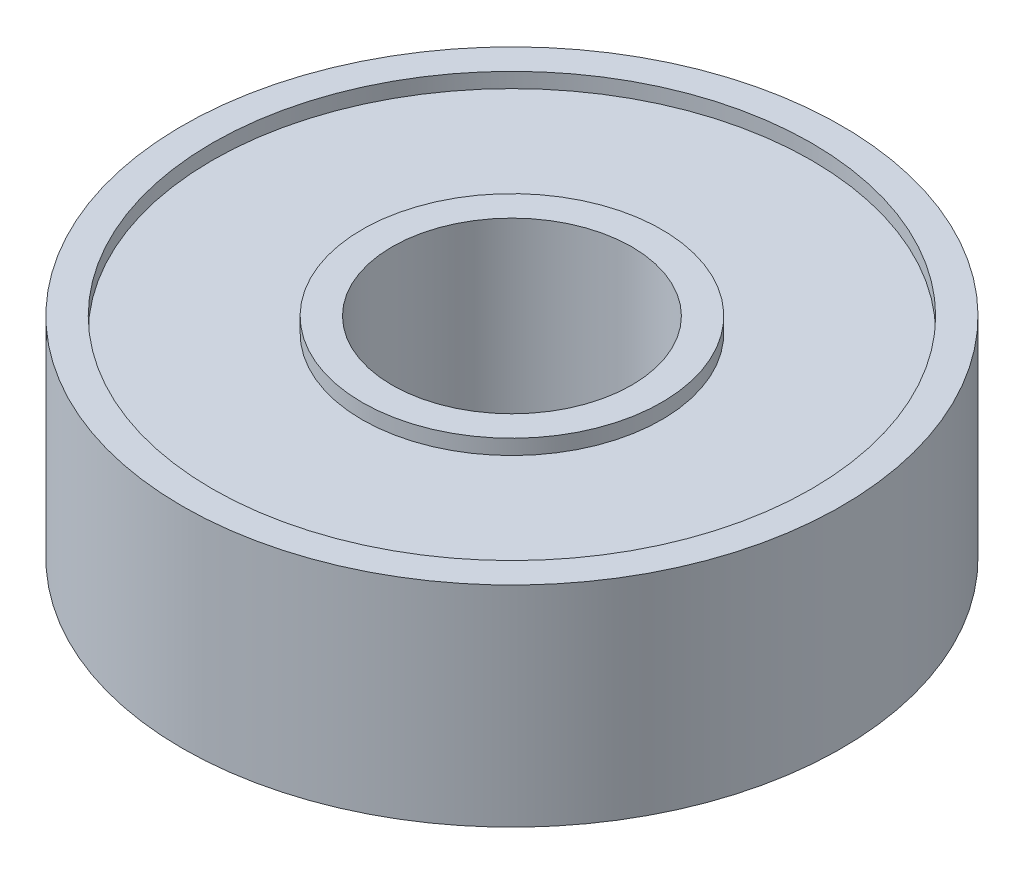
ISO-10303-21;
HEADER;
FILE_DESCRIPTION(('STEP AP214'),'2;1');
FILE_NAME('part.step','',(''),(''),'','','');
FILE_SCHEMA(('AUTOMOTIVE_DESIGN { 1 0 10303 214 1 1 1 1 }'));
ENDSEC;
DATA;
#1=APPLICATION_CONTEXT('core data for automotive mechanical design processes');
#2=APPLICATION_PROTOCOL_DEFINITION('international standard','automotive_design',2000,#1);
#3=PRODUCT_CONTEXT('',#1,'mechanical');
#4=PRODUCT('Part','Part','',(#3));
#5=PRODUCT_RELATED_PRODUCT_CATEGORY('part','',(#4));
#6=PRODUCT_DEFINITION_FORMATION('','',#4);
#7=PRODUCT_DEFINITION_CONTEXT('part definition',#1,'design');
#8=PRODUCT_DEFINITION('design','',#6,#7);
#9=PRODUCT_DEFINITION_SHAPE('','',#8);
#10=(LENGTH_UNIT() NAMED_UNIT(*) SI_UNIT(.MILLI.,.METRE.));
#11=(NAMED_UNIT(*) PLANE_ANGLE_UNIT() SI_UNIT($,.RADIAN.));
#12=(NAMED_UNIT(*) SI_UNIT($,.STERADIAN.) SOLID_ANGLE_UNIT());
#13=UNCERTAINTY_MEASURE_WITH_UNIT(LENGTH_MEASURE(1.E-05),#10,'distance_accuracy_value','');
#14=(GEOMETRIC_REPRESENTATION_CONTEXT(3) GLOBAL_UNCERTAINTY_ASSIGNED_CONTEXT((#13)) GLOBAL_UNIT_ASSIGNED_CONTEXT((#10,
#11,#12)) REPRESENTATION_CONTEXT('',''));
#15=CARTESIAN_POINT('',(0.,0.,0.));
#16=DIRECTION('',(0.,0.,1.));
#17=DIRECTION('',(1.,0.,0.));
#18=AXIS2_PLACEMENT_3D('',#15,#16,#17);
#19=CARTESIAN_POINT('',(0.,0.,0.));
#20=DIRECTION('',(0.,1.,0.));
#21=DIRECTION('',(0.,0.,1.));
#22=AXIS2_PLACEMENT_3D('',#19,#20,#21);
#23=PLANE('',#22);
#24=CARTESIAN_POINT('',(0.,0.,0.));
#25=DIRECTION('',(0.,1.,0.));
#26=DIRECTION('',(0.,0.,1.));
#27=AXIS2_PLACEMENT_3D('',#24,#25,#26);
#28=CIRCLE('',#27,4.);
#29=CARTESIAN_POINT('',(0.,0.,4.));
#30=VERTEX_POINT('',#29);
#31=EDGE_CURVE('E46',#30,#30,#28,.T.);
#32=ORIENTED_EDGE('',*,*,#31,.T.);
#33=EDGE_LOOP('',(#32));
#34=FACE_BOUND('',#33,.T.);
#35=CARTESIAN_POINT('',(0.,0.,0.));
#36=DIRECTION('',(0.,-1.,0.));
#37=DIRECTION('',(0.,0.,-1.));
#38=AXIS2_PLACEMENT_3D('',#35,#36,#37);
#39=CIRCLE('',#38,5.);
#40=CARTESIAN_POINT('',(0.,0.,-5.));
#41=VERTEX_POINT('',#40);
#42=EDGE_CURVE('E70',#41,#41,#39,.T.);
#43=ORIENTED_EDGE('',*,*,#42,.T.);
#44=EDGE_LOOP('',(#43));
#45=FACE_BOUND('',#44,.T.);
#46=ADVANCED_FACE('F35',(#34,#45),#23,.F.);
#47=CARTESIAN_POINT('',(0.,7.,0.));
#48=DIRECTION('',(0.,1.,0.));
#49=DIRECTION('',(0.,0.,1.));
#50=AXIS2_PLACEMENT_3D('',#47,#48,#49);
#51=PLANE('',#50);
#52=CARTESIAN_POINT('',(0.,7.,0.));
#53=DIRECTION('',(0.,1.,0.));
#54=DIRECTION('',(0.,0.,1.));
#55=AXIS2_PLACEMENT_3D('',#52,#53,#54);
#56=CIRCLE('',#55,4.);
#57=CARTESIAN_POINT('',(0.,7.,4.));
#58=VERTEX_POINT('',#57);
#59=EDGE_CURVE('E48',#58,#58,#56,.T.);
#60=ORIENTED_EDGE('',*,*,#59,.F.);
#61=EDGE_LOOP('',(#60));
#62=FACE_BOUND('',#61,.T.);
#63=CARTESIAN_POINT('',(0.,7.,0.));
#64=DIRECTION('',(0.,1.,0.));
#65=DIRECTION('',(0.,0.,1.));
#66=AXIS2_PLACEMENT_3D('',#63,#64,#65);
#67=CIRCLE('',#66,5.);
#68=CARTESIAN_POINT('',(0.,7.,5.));
#69=VERTEX_POINT('',#68);
#70=EDGE_CURVE('E58',#69,#69,#67,.T.);
#71=ORIENTED_EDGE('',*,*,#70,.T.);
#72=EDGE_LOOP('',(#71));
#73=FACE_BOUND('',#72,.T.);
#74=ADVANCED_FACE('F101',(#62,#73),#51,.T.);
#75=CARTESIAN_POINT('',(0.,7.,0.));
#76=DIRECTION('',(0.,-1.,0.));
#77=DIRECTION('',(0.,0.,-1.));
#78=AXIS2_PLACEMENT_3D('',#75,#76,#77);
#79=CYLINDRICAL_SURFACE('',#78,11.);
#80=CARTESIAN_POINT('',(0.,7.,0.));
#81=DIRECTION('',(0.,1.,0.));
#82=DIRECTION('',(0.,0.,1.));
#83=AXIS2_PLACEMENT_3D('',#80,#81,#82);
#84=CIRCLE('',#83,11.);
#85=CARTESIAN_POINT('',(0.,7.,11.));
#86=VERTEX_POINT('',#85);
#87=EDGE_CURVE('E10',#86,#86,#84,.T.);
#88=ORIENTED_EDGE('',*,*,#87,.F.);
#89=EDGE_LOOP('',(#88));
#90=FACE_BOUND('',#89,.T.);
#91=CARTESIAN_POINT('',(0.,0.,0.));
#92=DIRECTION('',(0.,1.,0.));
#93=DIRECTION('',(0.,0.,1.));
#94=AXIS2_PLACEMENT_3D('',#91,#92,#93);
#95=CIRCLE('',#94,11.);
#96=CARTESIAN_POINT('',(0.,0.,11.));
#97=VERTEX_POINT('',#96);
#98=EDGE_CURVE('E39',#97,#97,#95,.T.);
#99=ORIENTED_EDGE('',*,*,#98,.T.);
#100=EDGE_LOOP('',(#99));
#101=FACE_BOUND('',#100,.T.);
#102=ADVANCED_FACE('F37',(#90,#101),#79,.T.);
#103=CARTESIAN_POINT('',(0.,7.,0.));
#104=DIRECTION('',(0.,1.,0.));
#105=DIRECTION('',(0.,0.,1.));
#106=AXIS2_PLACEMENT_3D('',#103,#104,#105);
#107=CIRCLE('',#106,10.);
#108=CARTESIAN_POINT('',(0.,7.,10.));
#109=VERTEX_POINT('',#108);
#110=EDGE_CURVE('E54',#109,#109,#107,.T.);
#111=ORIENTED_EDGE('',*,*,#110,.F.);
#112=EDGE_LOOP('',(#111));
#113=FACE_BOUND('',#112,.T.);
#114=ORIENTED_EDGE('',*,*,#87,.T.);
#115=EDGE_LOOP('',(#114));
#116=FACE_BOUND('',#115,.T.);
#117=ADVANCED_FACE('F97',(#113,#116),#51,.T.);
#118=CARTESIAN_POINT('',(0.,0.,0.));
#119=DIRECTION('',(0.,-1.,0.));
#120=DIRECTION('',(0.,0.,-1.));
#121=AXIS2_PLACEMENT_3D('',#118,#119,#120);
#122=CIRCLE('',#121,10.);
#123=CARTESIAN_POINT('',(0.,0.,-10.));
#124=VERTEX_POINT('',#123);
#125=EDGE_CURVE('E66',#124,#124,#122,.T.);
#126=ORIENTED_EDGE('',*,*,#125,.F.);
#127=EDGE_LOOP('',(#126));
#128=FACE_BOUND('',#127,.T.);
#129=ORIENTED_EDGE('',*,*,#98,.F.);
#130=EDGE_LOOP('',(#129));
#131=FACE_BOUND('',#130,.T.);
#132=ADVANCED_FACE('F93',(#128,#131),#23,.F.);
#133=CARTESIAN_POINT('',(0.,0.,0.));
#134=DIRECTION('',(0.,1.,0.));
#135=DIRECTION('',(0.,0.,1.));
#136=AXIS2_PLACEMENT_3D('',#133,#134,#135);
#137=CYLINDRICAL_SURFACE('',#136,4.);
#138=ORIENTED_EDGE('',*,*,#31,.F.);
#139=EDGE_LOOP('',(#138));
#140=FACE_BOUND('',#139,.T.);
#141=ORIENTED_EDGE('',*,*,#59,.T.);
#142=EDGE_LOOP('',(#141));
#143=FACE_BOUND('',#142,.T.);
#144=ADVANCED_FACE('F96',(#140,#143),#137,.F.);
#145=CARTESIAN_POINT('',(0.,6.5,0.));
#146=DIRECTION('',(0.,1.,0.));
#147=DIRECTION('',(0.,0.,1.));
#148=AXIS2_PLACEMENT_3D('',#145,#146,#147);
#149=CYLINDRICAL_SURFACE('',#148,5.);
#150=CARTESIAN_POINT('',(0.,6.5,0.));
#151=DIRECTION('',(0.,1.,0.));
#152=DIRECTION('',(0.,0.,1.));
#153=AXIS2_PLACEMENT_3D('',#150,#151,#152);
#154=CIRCLE('',#153,5.);
#155=CARTESIAN_POINT('',(0.,6.5,5.));
#156=VERTEX_POINT('',#155);
#157=EDGE_CURVE('E57',#156,#156,#154,.T.);
#158=ORIENTED_EDGE('',*,*,#157,.T.);
#159=EDGE_LOOP('',(#158));
#160=FACE_BOUND('',#159,.T.);
#161=ORIENTED_EDGE('',*,*,#70,.F.);
#162=EDGE_LOOP('',(#161));
#163=FACE_BOUND('',#162,.T.);
#164=ADVANCED_FACE('F118',(#160,#163),#149,.T.);
#165=CARTESIAN_POINT('',(0.,6.5,0.));
#166=DIRECTION('',(0.,1.,0.));
#167=DIRECTION('',(0.,0.,1.));
#168=AXIS2_PLACEMENT_3D('',#165,#166,#167);
#169=CYLINDRICAL_SURFACE('',#168,10.);
#170=CARTESIAN_POINT('',(0.,6.5,0.));
#171=DIRECTION('',(0.,1.,0.));
#172=DIRECTION('',(0.,0.,1.));
#173=AXIS2_PLACEMENT_3D('',#170,#171,#172);
#174=CIRCLE('',#173,10.);
#175=CARTESIAN_POINT('',(0.,6.5,10.));
#176=VERTEX_POINT('',#175);
#177=EDGE_CURVE('E51',#176,#176,#174,.T.);
#178=ORIENTED_EDGE('',*,*,#177,.F.);
#179=EDGE_LOOP('',(#178));
#180=FACE_BOUND('',#179,.T.);
#181=ORIENTED_EDGE('',*,*,#110,.T.);
#182=EDGE_LOOP('',(#181));
#183=FACE_BOUND('',#182,.T.);
#184=ADVANCED_FACE('F122',(#180,#183),#169,.F.);
#185=CARTESIAN_POINT('',(0.,6.5,0.));
#186=DIRECTION('',(0.,1.,0.));
#187=DIRECTION('',(0.,0.,1.));
#188=AXIS2_PLACEMENT_3D('',#185,#186,#187);
#189=PLANE('',#188);
#190=ORIENTED_EDGE('',*,*,#157,.F.);
#191=EDGE_LOOP('',(#190));
#192=FACE_BOUND('',#191,.T.);
#193=ORIENTED_EDGE('',*,*,#177,.T.);
#194=EDGE_LOOP('',(#193));
#195=FACE_BOUND('',#194,.T.);
#196=ADVANCED_FACE('F126',(#192,#195),#189,.T.);
#197=CARTESIAN_POINT('',(0.,0.5,0.));
#198=DIRECTION('',(0.,-1.,0.));
#199=DIRECTION('',(0.,0.,-1.));
#200=AXIS2_PLACEMENT_3D('',#197,#198,#199);
#201=CYLINDRICAL_SURFACE('',#200,5.);
#202=CARTESIAN_POINT('',(0.,0.5,0.));
#203=DIRECTION('',(0.,-1.,0.));
#204=DIRECTION('',(0.,0.,-1.));
#205=AXIS2_PLACEMENT_3D('',#202,#203,#204);
#206=CIRCLE('',#205,5.);
#207=CARTESIAN_POINT('',(0.,0.5,-5.));
#208=VERTEX_POINT('',#207);
#209=EDGE_CURVE('E69',#208,#208,#206,.T.);
#210=ORIENTED_EDGE('',*,*,#209,.T.);
#211=EDGE_LOOP('',(#210));
#212=FACE_BOUND('',#211,.T.);
#213=ORIENTED_EDGE('',*,*,#42,.F.);
#214=EDGE_LOOP('',(#213));
#215=FACE_BOUND('',#214,.T.);
#216=ADVANCED_FACE('F78',(#212,#215),#201,.T.);
#217=CARTESIAN_POINT('',(0.,0.5,0.));
#218=DIRECTION('',(0.,-1.,0.));
#219=DIRECTION('',(0.,0.,-1.));
#220=AXIS2_PLACEMENT_3D('',#217,#218,#219);
#221=CYLINDRICAL_SURFACE('',#220,10.);
#222=CARTESIAN_POINT('',(0.,0.5,0.));
#223=DIRECTION('',(0.,-1.,0.));
#224=DIRECTION('',(0.,0.,-1.));
#225=AXIS2_PLACEMENT_3D('',#222,#223,#224);
#226=CIRCLE('',#225,10.);
#227=CARTESIAN_POINT('',(0.,0.5,-10.));
#228=VERTEX_POINT('',#227);
#229=EDGE_CURVE('E61',#228,#228,#226,.T.);
#230=ORIENTED_EDGE('',*,*,#229,.F.);
#231=EDGE_LOOP('',(#230));
#232=FACE_BOUND('',#231,.T.);
#233=ORIENTED_EDGE('',*,*,#125,.T.);
#234=EDGE_LOOP('',(#233));
#235=FACE_BOUND('',#234,.T.);
#236=ADVANCED_FACE('F84',(#232,#235),#221,.F.);
#237=CARTESIAN_POINT('',(0.,0.5,0.));
#238=DIRECTION('',(0.,-1.,0.));
#239=DIRECTION('',(0.,0.,-1.));
#240=AXIS2_PLACEMENT_3D('',#237,#238,#239);
#241=PLANE('',#240);
#242=ORIENTED_EDGE('',*,*,#209,.F.);
#243=EDGE_LOOP('',(#242));
#244=FACE_BOUND('',#243,.T.);
#245=ORIENTED_EDGE('',*,*,#229,.T.);
#246=EDGE_LOOP('',(#245));
#247=FACE_BOUND('',#246,.T.);
#248=ADVANCED_FACE('F81',(#244,#247),#241,.T.);
#249=CLOSED_SHELL('',(#46,#74,#102,#117,#132,#144,#164,#184,#196,#216,#236,#248));
#250=MANIFOLD_SOLID_BREP('B2',#249);
#251=ADVANCED_BREP_SHAPE_REPRESENTATION('',(#18,#250),#14);
#252=SHAPE_DEFINITION_REPRESENTATION(#9,#251);
ENDSEC;
END-ISO-10303-21;
